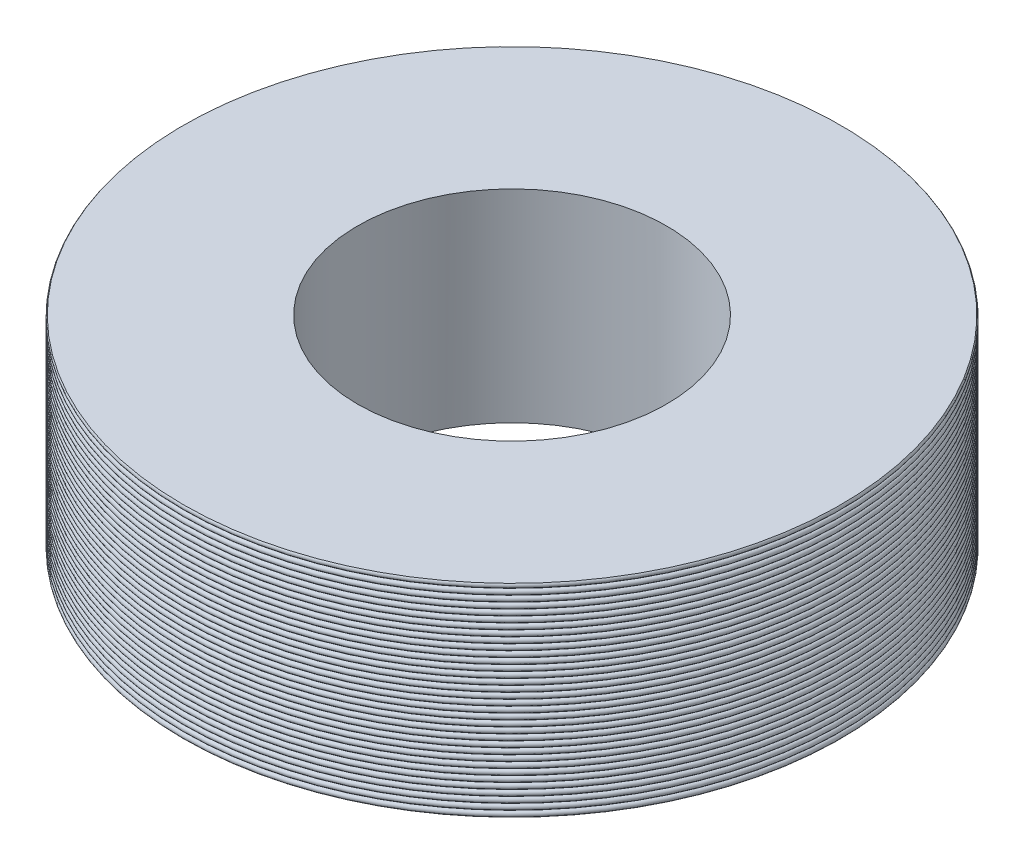
ISO-10303-21;
HEADER;
FILE_DESCRIPTION(('STEP AP214'),'2;1');
FILE_NAME('part.step','',(''),(''),'','','');
FILE_SCHEMA(('AUTOMOTIVE_DESIGN { 1 0 10303 214 1 1 1 1 }'));
ENDSEC;
DATA;
#1=APPLICATION_CONTEXT('core data for automotive mechanical design processes');
#2=APPLICATION_PROTOCOL_DEFINITION('international standard','automotive_design',2000,#1);
#3=PRODUCT_CONTEXT('',#1,'mechanical');
#4=PRODUCT('Part','Part','',(#3));
#5=PRODUCT_RELATED_PRODUCT_CATEGORY('part','',(#4));
#6=PRODUCT_DEFINITION_FORMATION('','',#4);
#7=PRODUCT_DEFINITION_CONTEXT('part definition',#1,'design');
#8=PRODUCT_DEFINITION('design','',#6,#7);
#9=PRODUCT_DEFINITION_SHAPE('','',#8);
#10=(LENGTH_UNIT() NAMED_UNIT(*) SI_UNIT(.MILLI.,.METRE.));
#11=(NAMED_UNIT(*) PLANE_ANGLE_UNIT() SI_UNIT($,.RADIAN.));
#12=(NAMED_UNIT(*) SI_UNIT($,.STERADIAN.) SOLID_ANGLE_UNIT());
#13=UNCERTAINTY_MEASURE_WITH_UNIT(LENGTH_MEASURE(1.E-05),#10,'distance_accuracy_value','');
#14=(GEOMETRIC_REPRESENTATION_CONTEXT(3) GLOBAL_UNCERTAINTY_ASSIGNED_CONTEXT((#13)) GLOBAL_UNIT_ASSIGNED_CONTEXT((#10,
#11,#12)) REPRESENTATION_CONTEXT('',''));
#15=CARTESIAN_POINT('',(0.,0.,0.));
#16=DIRECTION('',(0.,0.,1.));
#17=DIRECTION('',(1.,0.,0.));
#18=AXIS2_PLACEMENT_3D('',#15,#16,#17);
#19=CARTESIAN_POINT('',(-1.80163980901512E-11,31.625,3.05311331771918E-13));
#20=DIRECTION('',(0.,1.,0.));
#21=DIRECTION('',(0.,0.,1.));
#22=AXIS2_PLACEMENT_3D('',#19,#20,#21);
#23=TOROIDAL_SURFACE('',#22,95.1249985307958,0.874999999999956);
#24=CARTESIAN_POINT('',(-1.80024883889018E-11,30.75,3.29791749464903E-13));
#25=DIRECTION('',(0.,-1.,0.));
#26=DIRECTION('',(0.,0.,1.));
#27=AXIS2_PLACEMENT_3D('',#24,#25,#26);
#28=CIRCLE('',#27,95.1249985307958);
#29=CARTESIAN_POINT('',(-1.80193637788761E-11,30.75,95.1249985307961));
#30=VERTEX_POINT('',#29);
#31=EDGE_CURVE('E35',#30,#30,#28,.T.);
#32=ORIENTED_EDGE('',*,*,#31,.F.);
#33=EDGE_LOOP('',(#32));
#34=FACE_BOUND('',#33,.T.);
#35=CARTESIAN_POINT('',(-1.81273884791721E-11,32.4999999999994,3.29791749464903E-13));
#36=DIRECTION('',(0.,1.,0.));
#37=DIRECTION('',(0.,0.,1.));
#38=AXIS2_PLACEMENT_3D('',#35,#36,#37);
#39=CIRCLE('',#38,95.124999308604);
#40=CARTESIAN_POINT('',(-1.80193637788761E-11,32.4999999999994,95.1249993086043));
#41=VERTEX_POINT('',#40);
#42=EDGE_CURVE('E38',#41,#41,#39,.T.);
#43=ORIENTED_EDGE('',*,*,#42,.F.);
#44=EDGE_LOOP('',(#43));
#45=FACE_BOUND('',#44,.T.);
#46=ADVANCED_FACE('F15',(#34,#45),#23,.T.);
#47=CARTESIAN_POINT('',(-1.79053119608058E-11,29.875,3.19189119579733E-13));
#48=DIRECTION('',(0.,1.,0.));
#49=DIRECTION('',(0.,0.,1.));
#50=AXIS2_PLACEMENT_3D('',#47,#48,#49);
#51=TOROIDAL_SURFACE('',#50,95.1249992221977,0.874999611087508);
#52=CARTESIAN_POINT('',(-1.79192216620549E-11,28.9999999999993,2.18769447002387E-13));
#53=DIRECTION('',(0.,-1.,0.));
#54=DIRECTION('',(0.,0.,1.));
#55=AXIS2_PLACEMENT_3D('',#52,#53,#54);
#56=CIRCLE('',#55,95.1249992221984);
#57=CARTESIAN_POINT('',(-1.80193637788761E-11,28.9999999999993,95.1249992221987));
#58=VERTEX_POINT('',#57);
#59=EDGE_CURVE('E41',#58,#58,#56,.T.);
#60=ORIENTED_EDGE('',*,*,#59,.F.);
#61=EDGE_LOOP('',(#60));
#62=FACE_BOUND('',#61,.T.);
#63=ORIENTED_EDGE('',*,*,#31,.T.);
#64=EDGE_LOOP('',(#63));
#65=FACE_BOUND('',#64,.T.);
#66=ADVANCED_FACE('F458',(#62,#65),#51,.T.);
#67=CARTESIAN_POINT('',(-1.81273884791721E-11,33.375,3.33066907387547E-13));
#68=DIRECTION('',(0.,1.,0.));
#69=DIRECTION('',(0.,0.,1.));
#70=AXIS2_PLACEMENT_3D('',#67,#68,#69);
#71=TOROIDAL_SURFACE('',#70,95.1249993086034,0.874999654308353);
#72=ORIENTED_EDGE('',*,*,#42,.T.);
#73=EDGE_LOOP('',(#72));
#74=FACE_BOUND('',#73,.T.);
#75=CARTESIAN_POINT('',(-1.80302439645174E-11,34.25,3.99180688503975E-13));
#76=DIRECTION('',(0.,1.,0.));
#77=DIRECTION('',(0.,0.,1.));
#78=AXIS2_PLACEMENT_3D('',#75,#76,#77);
#79=CIRCLE('',#78,95.1249987036433);
#80=CARTESIAN_POINT('',(-1.80193637788761E-11,34.25,95.1249987036437));
#81=VERTEX_POINT('',#80);
#82=EDGE_CURVE('E44',#81,#81,#79,.T.);
#83=ORIENTED_EDGE('',*,*,#82,.F.);
#84=EDGE_LOOP('',(#83));
#85=FACE_BOUND('',#84,.T.);
#86=ADVANCED_FACE('F449',(#74,#85),#71,.T.);
#87=CARTESIAN_POINT('',(-1.80302758779591E-11,28.125,3.19189119579733E-13));
#88=DIRECTION('',(0.,1.,0.));
#89=DIRECTION('',(0.,0.,1.));
#90=AXIS2_PLACEMENT_3D('',#87,#88,#89);
#91=TOROIDAL_SURFACE('',#90,95.1249983579482,0.875000000000007);
#92=CARTESIAN_POINT('',(-1.80302439645174E-11,27.25,3.15913961657088E-13));
#93=DIRECTION('',(0.,-1.,0.));
#94=DIRECTION('',(0.,0.,1.));
#95=AXIS2_PLACEMENT_3D('',#92,#93,#94);
#96=CIRCLE('',#95,95.1249983579482);
#97=CARTESIAN_POINT('',(-1.80193637788761E-11,27.25,95.1249983579485));
#98=VERTEX_POINT('',#97);
#99=EDGE_CURVE('E47',#98,#98,#96,.T.);
#100=ORIENTED_EDGE('',*,*,#99,.F.);
#101=EDGE_LOOP('',(#100));
#102=FACE_BOUND('',#101,.T.);
#103=ORIENTED_EDGE('',*,*,#59,.T.);
#104=EDGE_LOOP('',(#103));
#105=FACE_BOUND('',#104,.T.);
#106=ADVANCED_FACE('F440',(#102,#105),#91,.T.);
#107=CARTESIAN_POINT('',(-1.80302439645174E-11,35.125,4.02455846426619E-13));
#108=DIRECTION('',(0.,1.,0.));
#109=DIRECTION('',(0.,0.,1.));
#110=AXIS2_PLACEMENT_3D('',#107,#108,#109);
#111=TOROIDAL_SURFACE('',#110,95.1249987036432,0.875000000000003);
#112=ORIENTED_EDGE('',*,*,#82,.T.);
#113=EDGE_LOOP('',(#112));
#114=FACE_BOUND('',#113,.T.);
#115=CARTESIAN_POINT('',(-1.80163661767096E-11,35.9999999999995,3.02036173849274E-13));
#116=DIRECTION('',(0.,1.,0.));
#117=DIRECTION('',(0.,0.,1.));
#118=AXIS2_PLACEMENT_3D('',#115,#116,#117);
#119=CIRCLE('',#118,95.1249993950544);
#120=CARTESIAN_POINT('',(-1.80193637788761E-11,35.9999999999995,95.1249993950547));
#121=VERTEX_POINT('',#120);
#122=EDGE_CURVE('E50',#121,#121,#119,.T.);
#123=ORIENTED_EDGE('',*,*,#122,.F.);
#124=EDGE_LOOP('',(#123));
#125=FACE_BOUND('',#124,.T.);
#126=ADVANCED_FACE('F431',(#114,#125),#111,.T.);
#127=CARTESIAN_POINT('',(-1.80302439645174E-11,26.3749999999999,3.05311331771918E-13));
#128=DIRECTION('',(0.,1.,0.));
#129=DIRECTION('',(0.,0.,1.));
#130=AXIS2_PLACEMENT_3D('',#127,#128,#129);
#131=TOROIDAL_SURFACE('',#130,95.1249991134206,0.874999556701025);
#132=CARTESIAN_POINT('',(-1.80163661767096E-11,25.499999999999,3.15913961657088E-13));
#133=DIRECTION('',(0.,-1.,0.));
#134=DIRECTION('',(0.,0.,1.));
#135=AXIS2_PLACEMENT_3D('',#132,#133,#134);
#136=CIRCLE('',#135,95.1249991134216);
#137=CARTESIAN_POINT('',(-1.80193637788761E-11,25.499999999999,95.1249991134219));
#138=VERTEX_POINT('',#137);
#139=EDGE_CURVE('E53',#138,#138,#136,.T.);
#140=ORIENTED_EDGE('',*,*,#139,.F.);
#141=EDGE_LOOP('',(#140));
#142=FACE_BOUND('',#141,.T.);
#143=ORIENTED_EDGE('',*,*,#99,.T.);
#144=EDGE_LOOP('',(#143));
#145=FACE_BOUND('',#144,.T.);
#146=ADVANCED_FACE('F422',(#142,#145),#131,.T.);
#147=CARTESIAN_POINT('',(-1.80163661767096E-11,36.875,3.05311331771918E-13));
#148=DIRECTION('',(0.,1.,0.));
#149=DIRECTION('',(0.,0.,1.));
#150=AXIS2_PLACEMENT_3D('',#147,#148,#149);
#151=TOROIDAL_SURFACE('',#150,95.1249993950539,0.87499969750684);
#152=ORIENTED_EDGE('',*,*,#122,.T.);
#153=EDGE_LOOP('',(#152));
#154=FACE_BOUND('',#153,.T.);
#155=CARTESIAN_POINT('',(-1.81135106913643E-11,37.75,3.15913961657088E-13));
#156=DIRECTION('',(0.,1.,0.));
#157=DIRECTION('',(0.,0.,1.));
#158=AXIS2_PLACEMENT_3D('',#155,#156,#157);
#159=CIRCLE('',#158,95.1249988764909);
#160=CARTESIAN_POINT('',(-1.80193637788761E-11,37.75,95.1249988764913));
#161=VERTEX_POINT('',#160);
#162=EDGE_CURVE('E56',#161,#161,#159,.T.);
#163=ORIENTED_EDGE('',*,*,#162,.F.);
#164=EDGE_LOOP('',(#163));
#165=FACE_BOUND('',#164,.T.);
#166=ADVANCED_FACE('F413',(#154,#165),#151,.T.);
#167=CARTESIAN_POINT('',(-1.80163661767096E-11,24.625,4.02455846426619E-13));
#168=DIRECTION('',(0.,1.,0.));
#169=DIRECTION('',(0.,0.,1.));
#170=AXIS2_PLACEMENT_3D('',#167,#168,#169);
#171=TOROIDAL_SURFACE('',#170,95.1249981403979,0.875000000000002);
#172=CARTESIAN_POINT('',(-1.80024883889018E-11,23.75,3.15913961657088E-13));
#173=DIRECTION('',(0.,-1.,0.));
#174=DIRECTION('',(0.,0.,1.));
#175=AXIS2_PLACEMENT_3D('',#172,#173,#174);
#176=CIRCLE('',#175,95.1249981403979);
#177=CARTESIAN_POINT('',(-1.80193637788761E-11,23.75,95.1249981403983));
#178=VERTEX_POINT('',#177);
#179=EDGE_CURVE('E59',#178,#178,#176,.T.);
#180=ORIENTED_EDGE('',*,*,#179,.F.);
#181=EDGE_LOOP('',(#180));
#182=FACE_BOUND('',#181,.T.);
#183=ORIENTED_EDGE('',*,*,#139,.T.);
#184=EDGE_LOOP('',(#183));
#185=FACE_BOUND('',#184,.T.);
#186=ADVANCED_FACE('F404',(#182,#185),#171,.T.);
#187=CARTESIAN_POINT('',(-1.81135106913643E-11,38.625,3.19189119579733E-13));
#188=DIRECTION('',(0.,1.,0.));
#189=DIRECTION('',(0.,0.,1.));
#190=AXIS2_PLACEMENT_3D('',#187,#188,#189);
#191=TOROIDAL_SURFACE('',#190,95.1249988764909,0.875000000000001);
#192=ORIENTED_EDGE('',*,*,#162,.T.);
#193=EDGE_LOOP('',(#192));
#194=FACE_BOUND('',#193,.T.);
#195=CARTESIAN_POINT('',(-1.80163661767096E-11,39.4999999999996,3.02036173849274E-13));
#196=DIRECTION('',(0.,1.,0.));
#197=DIRECTION('',(0.,0.,1.));
#198=AXIS2_PLACEMENT_3D('',#195,#196,#197);
#199=CIRCLE('',#198,95.1249994814571);
#200=CARTESIAN_POINT('',(-1.80193637788761E-11,39.4999999999996,95.1249994814574));
#201=VERTEX_POINT('',#200);
#202=EDGE_CURVE('E62',#201,#201,#199,.T.);
#203=ORIENTED_EDGE('',*,*,#202,.F.);
#204=EDGE_LOOP('',(#203));
#205=FACE_BOUND('',#204,.T.);
#206=ADVANCED_FACE('F395',(#194,#205),#191,.T.);
#207=CARTESIAN_POINT('',(-1.80024883889018E-11,22.875,3.19189119579733E-13));
#208=DIRECTION('',(0.,1.,0.));
#209=DIRECTION('',(0.,0.,1.));
#210=AXIS2_PLACEMENT_3D('',#207,#208,#209);
#211=TOROIDAL_SURFACE('',#210,95.124999026971,0.874999513502155);
#212=CARTESIAN_POINT('',(-1.79192216620549E-11,21.9999999999989,3.15913961657088E-13));
#213=DIRECTION('',(0.,-1.,0.));
#214=DIRECTION('',(0.,0.,1.));
#215=AXIS2_PLACEMENT_3D('',#212,#213,#214);
#216=CIRCLE('',#215,95.1249990269722);
#217=CARTESIAN_POINT('',(-1.80193637788761E-11,21.9999999999989,95.1249990269725));
#218=VERTEX_POINT('',#217);
#219=EDGE_CURVE('E65',#218,#218,#216,.T.);
#220=ORIENTED_EDGE('',*,*,#219,.F.);
#221=EDGE_LOOP('',(#220));
#222=FACE_BOUND('',#221,.T.);
#223=ORIENTED_EDGE('',*,*,#179,.T.);
#224=EDGE_LOOP('',(#223));
#225=FACE_BOUND('',#224,.T.);
#226=ADVANCED_FACE('F386',(#222,#225),#211,.T.);
#227=CARTESIAN_POINT('',(-1.80163661767096E-11,40.3750000000001,3.05311331771918E-13));
#228=DIRECTION('',(0.,1.,0.));
#229=DIRECTION('',(0.,0.,1.));
#230=AXIS2_PLACEMENT_3D('',#227,#228,#229);
#231=TOROIDAL_SURFACE('',#230,95.1249994814567,0.874999740729252);
#232=ORIENTED_EDGE('',*,*,#202,.T.);
#233=EDGE_LOOP('',(#232));
#234=FACE_BOUND('',#233,.T.);
#235=CARTESIAN_POINT('',(-1.80302439645174E-11,41.25,3.15913961657088E-13));
#236=DIRECTION('',(0.,1.,0.));
#237=DIRECTION('',(0.,0.,1.));
#238=AXIS2_PLACEMENT_3D('',#235,#236,#237);
#239=CIRCLE('',#238,95.1249990493385);
#240=CARTESIAN_POINT('',(-1.80193637788761E-11,41.25,95.1249990493388));
#241=VERTEX_POINT('',#240);
#242=EDGE_CURVE('E68',#241,#241,#239,.T.);
#243=ORIENTED_EDGE('',*,*,#242,.F.);
#244=EDGE_LOOP('',(#243));
#245=FACE_BOUND('',#244,.T.);
#246=ADVANCED_FACE('F377',(#234,#245),#231,.T.);
#247=CARTESIAN_POINT('',(-1.80163661767096E-11,21.1250000000001,3.33066907387547E-13));
#248=DIRECTION('',(0.,1.,0.));
#249=DIRECTION('',(0.,0.,1.));
#250=AXIS2_PLACEMENT_3D('',#247,#248,#249);
#251=TOROIDAL_SURFACE('',#250,95.1249979675504,0.875000000000001);
#252=CARTESIAN_POINT('',(-1.80163661767096E-11,20.2500000000001,3.15913961657088E-13));
#253=DIRECTION('',(0.,-1.,0.));
#254=DIRECTION('',(0.,0.,1.));
#255=AXIS2_PLACEMENT_3D('',#252,#253,#254);
#256=CIRCLE('',#255,95.1249979675504);
#257=CARTESIAN_POINT('',(-1.80193637788761E-11,20.2500000000001,95.1249979675507));
#258=VERTEX_POINT('',#257);
#259=EDGE_CURVE('E71',#258,#258,#256,.T.);
#260=ORIENTED_EDGE('',*,*,#259,.F.);
#261=EDGE_LOOP('',(#260));
#262=FACE_BOUND('',#261,.T.);
#263=ORIENTED_EDGE('',*,*,#219,.T.);
#264=EDGE_LOOP('',(#263));
#265=FACE_BOUND('',#264,.T.);
#266=ADVANCED_FACE('F368',(#262,#265),#251,.T.);
#267=CARTESIAN_POINT('',(-1.80301801376346E-11,42.125,3.19189119579733E-13));
#268=DIRECTION('',(0.,1.,0.));
#269=DIRECTION('',(-1.,0.,0.));
#270=AXIS2_PLACEMENT_3D('',#267,#268,#269);
#271=TOROIDAL_SURFACE('',#270,95.1249990493385,0.875000000000003);
#272=ORIENTED_EDGE('',*,*,#242,.T.);
#273=EDGE_LOOP('',(#272));
#274=FACE_BOUND('',#273,.T.);
#275=CARTESIAN_POINT('',(-1.79330994498627E-11,42.9999999999997,3.15913961657088E-13));
#276=DIRECTION('',(0.,1.,0.));
#277=DIRECTION('',(0.,0.,1.));
#278=AXIS2_PLACEMENT_3D('',#275,#276,#277);
#279=CIRCLE('',#278,95.1249995678305);
#280=CARTESIAN_POINT('',(-1.80193637788761E-11,42.9999999999997,95.1249995678309));
#281=VERTEX_POINT('',#280);
#282=EDGE_CURVE('E74',#281,#281,#279,.T.);
#283=ORIENTED_EDGE('',*,*,#282,.F.);
#284=EDGE_LOOP('',(#283));
#285=FACE_BOUND('',#284,.T.);
#286=ADVANCED_FACE('F359',(#274,#285),#271,.T.);
#287=CARTESIAN_POINT('',(-1.80163661767096E-11,19.3750000000001,4.16333634234434E-13));
#288=DIRECTION('',(0.,1.,0.));
#289=DIRECTION('',(0.,0.,1.));
#290=AXIS2_PLACEMENT_3D('',#287,#288,#289);
#291=TOROIDAL_SURFACE('',#290,95.1249989405547,0.874999470286612);
#292=CARTESIAN_POINT('',(-1.80302439645174E-11,18.4999999999987,2.88158386041459E-13));
#293=DIRECTION('',(0.,-1.,0.));
#294=DIRECTION('',(0.,0.,1.));
#295=AXIS2_PLACEMENT_3D('',#292,#293,#294);
#296=CIRCLE('',#295,95.1249989405562);
#297=CARTESIAN_POINT('',(-1.80193637788761E-11,18.4999999999987,95.1249989405565));
#298=VERTEX_POINT('',#297);
#299=EDGE_CURVE('E77',#298,#298,#296,.T.);
#300=ORIENTED_EDGE('',*,*,#299,.F.);
#301=EDGE_LOOP('',(#300));
#302=FACE_BOUND('',#301,.T.);
#303=ORIENTED_EDGE('',*,*,#259,.T.);
#304=EDGE_LOOP('',(#303));
#305=FACE_BOUND('',#304,.T.);
#306=ADVANCED_FACE('F350',(#302,#305),#291,.T.);
#307=CARTESIAN_POINT('',(-1.79330356229803E-11,43.875,3.19189119579733E-13));
#308=DIRECTION('',(0.,1.,0.));
#309=DIRECTION('',(0.,0.,1.));
#310=AXIS2_PLACEMENT_3D('',#307,#308,#309);
#311=TOROIDAL_SURFACE('',#310,95.1249995678303,0.874999783966107);
#312=ORIENTED_EDGE('',*,*,#282,.T.);
#313=EDGE_LOOP('',(#312));
#314=FACE_BOUND('',#313,.T.);
#315=CARTESIAN_POINT('',(-1.80302439645174E-11,44.75,3.15913961657088E-13));
#316=DIRECTION('',(0.,1.,0.));
#317=DIRECTION('',(0.,0.,1.));
#318=AXIS2_PLACEMENT_3D('',#315,#316,#317);
#319=CIRCLE('',#318,95.124999222186);
#320=CARTESIAN_POINT('',(-1.80193637788761E-11,44.75,95.1249992221863));
#321=VERTEX_POINT('',#320);
#322=EDGE_CURVE('E80',#321,#321,#319,.T.);
#323=ORIENTED_EDGE('',*,*,#322,.F.);
#324=EDGE_LOOP('',(#323));
#325=FACE_BOUND('',#324,.T.);
#326=ADVANCED_FACE('F341',(#314,#325),#311,.T.);
#327=CARTESIAN_POINT('',(-1.79330994498627E-11,17.6250000000001,3.19189119579733E-13));
#328=DIRECTION('',(0.,1.,0.));
#329=DIRECTION('',(0.,0.,1.));
#330=AXIS2_PLACEMENT_3D('',#327,#328,#329);
#331=TOROIDAL_SURFACE('',#330,95.1249977947028,0.875000000000003);
#332=CARTESIAN_POINT('',(-1.80302439645174E-11,16.7500000000001,3.15913961657088E-13));
#333=DIRECTION('',(0.,-1.,0.));
#334=DIRECTION('',(0.,0.,1.));
#335=AXIS2_PLACEMENT_3D('',#332,#333,#334);
#336=CIRCLE('',#335,95.1249977947029);
#337=CARTESIAN_POINT('',(-1.80193637788761E-11,16.7500000000001,95.1249977947032));
#338=VERTEX_POINT('',#337);
#339=EDGE_CURVE('E83',#338,#338,#336,.T.);
#340=ORIENTED_EDGE('',*,*,#339,.F.);
#341=EDGE_LOOP('',(#340));
#342=FACE_BOUND('',#341,.T.);
#343=ORIENTED_EDGE('',*,*,#299,.T.);
#344=EDGE_LOOP('',(#343));
#345=FACE_BOUND('',#344,.T.);
#346=ADVANCED_FACE('F332',(#342,#345),#331,.T.);
#347=CARTESIAN_POINT('',(-1.80302439645174E-11,45.625,3.19189119579733E-13));
#348=DIRECTION('',(0.,1.,0.));
#349=DIRECTION('',(0.,0.,1.));
#350=AXIS2_PLACEMENT_3D('',#347,#348,#349);
#351=TOROIDAL_SURFACE('',#350,95.124999222186,0.874999999999987);
#352=ORIENTED_EDGE('',*,*,#322,.T.);
#353=EDGE_LOOP('',(#352));
#354=FACE_BOUND('',#353,.T.);
#355=CARTESIAN_POINT('',(-1.80163661767096E-11,46.5,3.02036173849274E-13));
#356=DIRECTION('',(0.,1.,0.));
#357=DIRECTION('',(0.,0.,1.));
#358=AXIS2_PLACEMENT_3D('',#355,#356,#357);
#359=CIRCLE('',#358,95.1249992653979);
#360=CARTESIAN_POINT('',(-1.80193637788761E-11,46.5,95.1249992653982));
#361=VERTEX_POINT('',#360);
#362=EDGE_CURVE('E86',#361,#361,#359,.T.);
#363=ORIENTED_EDGE('',*,*,#362,.F.);
#364=EDGE_LOOP('',(#363));
#365=FACE_BOUND('',#364,.T.);
#366=ADVANCED_FACE('F323',(#354,#365),#351,.T.);
#367=CARTESIAN_POINT('',(-1.79192216620549E-11,15.8750000000001,3.19189119579733E-13));
#368=DIRECTION('',(0.,1.,0.));
#369=DIRECTION('',(0.,0.,1.));
#370=AXIS2_PLACEMENT_3D('',#367,#368,#369);
#371=TOROIDAL_SURFACE('',#370,95.1249988541289,0.874999427075917);
#372=CARTESIAN_POINT('',(-1.80163661767096E-11,14.9999999999985,3.15913961657088E-13));
#373=DIRECTION('',(0.,-1.,0.));
#374=DIRECTION('',(0.,0.,1.));
#375=AXIS2_PLACEMENT_3D('',#372,#373,#374);
#376=CIRCLE('',#375,95.1249988541305);
#377=CARTESIAN_POINT('',(-1.80193637788761E-11,14.9999999999985,95.1249988541308));
#378=VERTEX_POINT('',#377);
#379=EDGE_CURVE('E89',#378,#378,#376,.T.);
#380=ORIENTED_EDGE('',*,*,#379,.F.);
#381=EDGE_LOOP('',(#380));
#382=FACE_BOUND('',#381,.T.);
#383=ORIENTED_EDGE('',*,*,#339,.T.);
#384=EDGE_LOOP('',(#383));
#385=FACE_BOUND('',#384,.T.);
#386=ADVANCED_FACE('F314',(#382,#385),#371,.T.);
#387=CARTESIAN_POINT('',(-1.80163661767096E-11,47.375,3.05311331771918E-13));
#388=DIRECTION('',(0.,1.,0.));
#389=DIRECTION('',(0.,0.,1.));
#390=AXIS2_PLACEMENT_3D('',#387,#388,#389);
#391=TOROIDAL_SURFACE('',#390,95.1249992653979,0.875000021605947);
#392=ORIENTED_EDGE('',*,*,#362,.T.);
#393=EDGE_LOOP('',(#392));
#394=FACE_BOUND('',#393,.T.);
#395=CARTESIAN_POINT('',(-1.80024883889018E-11,48.25,3.29791749464903E-13));
#396=DIRECTION('',(0.,1.,0.));
#397=DIRECTION('',(0.,0.,1.));
#398=AXIS2_PLACEMENT_3D('',#395,#396,#397);
#399=CIRCLE('',#398,95.1249993950336);
#400=CARTESIAN_POINT('',(-1.80193637788761E-11,48.25,95.1249993950339));
#401=VERTEX_POINT('',#400);
#402=EDGE_CURVE('E92',#401,#401,#399,.T.);
#403=ORIENTED_EDGE('',*,*,#402,.F.);
#404=EDGE_LOOP('',(#403));
#405=FACE_BOUND('',#404,.T.);
#406=ADVANCED_FACE('F305',(#394,#405),#391,.T.);
#407=CARTESIAN_POINT('',(-1.80163661767096E-11,14.1250000000002,3.19189119579733E-13));
#408=DIRECTION('',(0.,1.,0.));
#409=DIRECTION('',(0.,0.,1.));
#410=AXIS2_PLACEMENT_3D('',#407,#408,#409);
#411=TOROIDAL_SURFACE('',#410,95.1249976218553,0.875000000000039);
#412=CARTESIAN_POINT('',(-1.80302439645174E-11,13.2500000000001,3.15913961657088E-13));
#413=DIRECTION('',(0.,-1.,0.));
#414=DIRECTION('',(0.,0.,1.));
#415=AXIS2_PLACEMENT_3D('',#412,#413,#414);
#416=CIRCLE('',#415,95.1249976218553);
#417=CARTESIAN_POINT('',(-1.80193637788761E-11,13.2500000000001,95.1249976218556));
#418=VERTEX_POINT('',#417);
#419=EDGE_CURVE('E95',#418,#418,#416,.T.);
#420=ORIENTED_EDGE('',*,*,#419,.F.);
#421=EDGE_LOOP('',(#420));
#422=FACE_BOUND('',#421,.T.);
#423=ORIENTED_EDGE('',*,*,#379,.T.);
#424=EDGE_LOOP('',(#423));
#425=FACE_BOUND('',#424,.T.);
#426=ADVANCED_FACE('F296',(#422,#425),#411,.T.);
#427=CARTESIAN_POINT('',(-1.80024883889018E-11,49.125,3.33066907387547E-13));
#428=DIRECTION('',(0.,1.,0.));
#429=DIRECTION('',(0.,0.,1.));
#430=AXIS2_PLACEMENT_3D('',#427,#428,#429);
#431=TOROIDAL_SURFACE('',#430,95.1249993950336,0.875000000000003);
#432=ORIENTED_EDGE('',*,*,#402,.T.);
#433=EDGE_LOOP('',(#432));
#434=FACE_BOUND('',#433,.T.);
#435=CARTESIAN_POINT('',(-1.80163661767096E-11,50.,3.15913961657088E-13));
#436=DIRECTION('',(0.,1.,0.));
#437=DIRECTION('',(0.,0.,1.));
#438=AXIS2_PLACEMENT_3D('',#435,#436,#437);
#439=CIRCLE('',#438,95.1249994382455);
#440=CARTESIAN_POINT('',(-1.80193637788761E-11,50.,95.1249994382458));
#441=VERTEX_POINT('',#440);
#442=EDGE_CURVE('E98',#441,#441,#439,.T.);
#443=ORIENTED_EDGE('',*,*,#442,.F.);
#444=EDGE_LOOP('',(#443));
#445=FACE_BOUND('',#444,.T.);
#446=ADVANCED_FACE('F287',(#434,#445),#431,.T.);
#447=CARTESIAN_POINT('',(-1.80163821334304E-11,12.3750000000001,3.19189119579733E-13));
#448=DIRECTION('',(0.,1.,0.));
#449=DIRECTION('',(-1.,0.,0.));
#450=AXIS2_PLACEMENT_3D('',#447,#448,#449);
#451=TOROIDAL_SURFACE('',#450,95.1249987677119,0.874999383860762);
#452=CARTESIAN_POINT('',(-1.81273884791721E-11,11.4999999999982,3.15913961657088E-13));
#453=DIRECTION('',(0.,-1.,0.));
#454=DIRECTION('',(0.,0.,1.));
#455=AXIS2_PLACEMENT_3D('',#452,#453,#454);
#456=CIRCLE('',#455,95.1249987677138);
#457=CARTESIAN_POINT('',(-1.80193637788761E-11,11.4999999999982,95.1249987677141));
#458=VERTEX_POINT('',#457);
#459=EDGE_CURVE('E101',#458,#458,#456,.T.);
#460=ORIENTED_EDGE('',*,*,#459,.F.);
#461=EDGE_LOOP('',(#460));
#462=FACE_BOUND('',#461,.T.);
#463=ORIENTED_EDGE('',*,*,#419,.T.);
#464=EDGE_LOOP('',(#463));
#465=FACE_BOUND('',#464,.T.);
#466=ADVANCED_FACE('F278',(#462,#465),#451,.T.);
#467=CARTESIAN_POINT('',(-1.80163023498271E-11,50.8750000000001,3.19189119579733E-13));
#468=DIRECTION('',(0.,1.,0.));
#469=DIRECTION('',(0.,0.,1.));
#470=AXIS2_PLACEMENT_3D('',#467,#468,#469);
#471=TOROIDAL_SURFACE('',#470,95.1249994382455,0.87500002160601);
#472=ORIENTED_EDGE('',*,*,#442,.T.);
#473=EDGE_LOOP('',(#472));
#474=FACE_BOUND('',#473,.T.);
#475=CARTESIAN_POINT('',(-1.80024883889018E-11,51.7499999999999,3.15913961657088E-13));
#476=DIRECTION('',(0.,1.,0.));
#477=DIRECTION('',(0.,0.,1.));
#478=AXIS2_PLACEMENT_3D('',#475,#476,#477);
#479=CIRCLE('',#478,95.1249995678811);
#480=CARTESIAN_POINT('',(-1.80193637788761E-11,51.7499999999999,95.1249995678814));
#481=VERTEX_POINT('',#480);
#482=EDGE_CURVE('E104',#481,#481,#479,.T.);
#483=ORIENTED_EDGE('',*,*,#482,.F.);
#484=EDGE_LOOP('',(#483));
#485=FACE_BOUND('',#484,.T.);
#486=ADVANCED_FACE('F269',(#474,#485),#471,.T.);
#487=CARTESIAN_POINT('',(-1.80163821334306E-11,10.6250000000001,3.05311331771918E-13));
#488=DIRECTION('',(0.,1.,0.));
#489=DIRECTION('',(0.,0.,1.));
#490=AXIS2_PLACEMENT_3D('',#487,#488,#489);
#491=TOROIDAL_SURFACE('',#490,95.1249974490077,0.875000000000017);
#492=CARTESIAN_POINT('',(-1.80163661767096E-11,9.75000000000009,2.18769447002387E-13));
#493=DIRECTION('',(0.,-1.,0.));
#494=DIRECTION('',(0.,0.,1.));
#495=AXIS2_PLACEMENT_3D('',#492,#493,#494);
#496=CIRCLE('',#495,95.1249974490078);
#497=CARTESIAN_POINT('',(-1.80193637788761E-11,9.75000000000009,95.124997449008));
#498=VERTEX_POINT('',#497);
#499=EDGE_CURVE('E107',#498,#498,#496,.T.);
#500=ORIENTED_EDGE('',*,*,#499,.F.);
#501=EDGE_LOOP('',(#500));
#502=FACE_BOUND('',#501,.T.);
#503=ORIENTED_EDGE('',*,*,#459,.T.);
#504=EDGE_LOOP('',(#503));
#505=FACE_BOUND('',#504,.T.);
#506=ADVANCED_FACE('F260',(#502,#505),#491,.T.);
#507=CARTESIAN_POINT('',(-1.80024883889018E-11,52.6249999999999,3.19189119579733E-13));
#508=DIRECTION('',(0.,1.,0.));
#509=DIRECTION('',(0.,0.,1.));
#510=AXIS2_PLACEMENT_3D('',#507,#508,#509);
#511=TOROIDAL_SURFACE('',#510,95.124999567881,0.875000000000053);
#512=ORIENTED_EDGE('',*,*,#482,.T.);
#513=EDGE_LOOP('',(#512));
#514=FACE_BOUND('',#513,.T.);
#515=CARTESIAN_POINT('',(-1.80302439645174E-11,53.4999999999999,3.15913961657088E-13));
#516=DIRECTION('',(0.,1.,0.));
#517=DIRECTION('',(0.,0.,1.));
#518=AXIS2_PLACEMENT_3D('',#515,#516,#517);
#519=CIRCLE('',#518,95.124999611093);
#520=CARTESIAN_POINT('',(-1.80193637788761E-11,53.4999999999999,95.1249996110933));
#521=VERTEX_POINT('',#520);
#522=EDGE_CURVE('E110',#521,#521,#519,.T.);
#523=ORIENTED_EDGE('',*,*,#522,.F.);
#524=EDGE_LOOP('',(#523));
#525=FACE_BOUND('',#524,.T.);
#526=ADVANCED_FACE('F251',(#514,#525),#511,.T.);
#527=CARTESIAN_POINT('',(-1.80302439645174E-11,8.8750000000001,3.05311331771918E-13));
#528=DIRECTION('',(0.,1.,0.));
#529=DIRECTION('',(0.,0.,1.));
#530=AXIS2_PLACEMENT_3D('',#527,#528,#529);
#531=TOROIDAL_SURFACE('',#530,95.1249986812865,0.874999340649848);
#532=CARTESIAN_POINT('',(-1.80163661767096E-11,7.99999999999798,3.15913961657088E-13));
#533=DIRECTION('',(0.,-1.,0.));
#534=DIRECTION('',(0.,0.,1.));
#535=AXIS2_PLACEMENT_3D('',#532,#533,#534);
#536=CIRCLE('',#535,95.1249986812886);
#537=CARTESIAN_POINT('',(-1.80193637788761E-11,7.99999999999798,95.1249986812889));
#538=VERTEX_POINT('',#537);
#539=EDGE_CURVE('E113',#538,#538,#536,.T.);
#540=ORIENTED_EDGE('',*,*,#539,.F.);
#541=EDGE_LOOP('',(#540));
#542=FACE_BOUND('',#541,.T.);
#543=ORIENTED_EDGE('',*,*,#499,.T.);
#544=EDGE_LOOP('',(#543));
#545=FACE_BOUND('',#544,.T.);
#546=ADVANCED_FACE('F242',(#542,#545),#531,.T.);
#547=CARTESIAN_POINT('',(-1.80302439645174E-11,54.3749999999999,3.19189119579733E-13));
#548=DIRECTION('',(0.,1.,0.));
#549=DIRECTION('',(0.,0.,1.));
#550=AXIS2_PLACEMENT_3D('',#547,#548,#549);
#551=TOROIDAL_SURFACE('',#550,95.124999611093,0.875000021605948);
#552=ORIENTED_EDGE('',*,*,#522,.T.);
#553=EDGE_LOOP('',(#552));
#554=FACE_BOUND('',#553,.T.);
#555=CARTESIAN_POINT('',(-1.80163661767096E-11,55.2499999999999,3.15913961657088E-13));
#556=DIRECTION('',(0.,1.,0.));
#557=DIRECTION('',(0.,0.,1.));
#558=AXIS2_PLACEMENT_3D('',#555,#556,#557);
#559=CIRCLE('',#558,95.1249997407287);
#560=CARTESIAN_POINT('',(-1.80193637788761E-11,55.2499999999999,95.124999740729));
#561=VERTEX_POINT('',#560);
#562=EDGE_CURVE('E116',#561,#561,#559,.T.);
#563=ORIENTED_EDGE('',*,*,#562,.F.);
#564=EDGE_LOOP('',(#563));
#565=FACE_BOUND('',#564,.T.);
#566=ADVANCED_FACE('F233',(#554,#565),#551,.T.);
#567=CARTESIAN_POINT('',(-1.80163661767096E-11,7.12500000000012,2.35922392732846E-13));
#568=DIRECTION('',(0.,1.,0.));
#569=DIRECTION('',(0.,0.,1.));
#570=AXIS2_PLACEMENT_3D('',#567,#568,#569);
#571=TOROIDAL_SURFACE('',#570,95.1249972761603,0.874999999999961);
#572=CARTESIAN_POINT('',(-1.80163661767096E-11,6.25000000000011,2.18769447002387E-13));
#573=DIRECTION('',(0.,-1.,0.));
#574=DIRECTION('',(0.,0.,1.));
#575=AXIS2_PLACEMENT_3D('',#572,#573,#574);
#576=CIRCLE('',#575,95.1249972761602);
#577=CARTESIAN_POINT('',(-1.80193637788761E-11,6.25000000000011,95.1249972761605));
#578=VERTEX_POINT('',#577);
#579=EDGE_CURVE('E119',#578,#578,#576,.T.);
#580=ORIENTED_EDGE('',*,*,#579,.F.);
#581=EDGE_LOOP('',(#580));
#582=FACE_BOUND('',#581,.T.);
#583=ORIENTED_EDGE('',*,*,#539,.T.);
#584=EDGE_LOOP('',(#583));
#585=FACE_BOUND('',#584,.T.);
#586=ADVANCED_FACE('F224',(#582,#585),#571,.T.);
#587=CARTESIAN_POINT('',(-1.80163661767096E-11,56.1249999999999,3.19189119579733E-13));
#588=DIRECTION('',(0.,1.,0.));
#589=DIRECTION('',(0.,0.,1.));
#590=AXIS2_PLACEMENT_3D('',#587,#588,#589);
#591=TOROIDAL_SURFACE('',#590,95.1249997407287,0.875000000000006);
#592=ORIENTED_EDGE('',*,*,#562,.T.);
#593=EDGE_LOOP('',(#592));
#594=FACE_BOUND('',#593,.T.);
#595=CARTESIAN_POINT('',(-1.80302439645174E-11,56.9999999999999,3.02036173849274E-13));
#596=DIRECTION('',(0.,1.,0.));
#597=DIRECTION('',(0.,0.,1.));
#598=AXIS2_PLACEMENT_3D('',#595,#596,#597);
#599=CIRCLE('',#598,95.1249997839406);
#600=CARTESIAN_POINT('',(-1.80193637788761E-11,56.9999999999999,95.1249997839409));
#601=VERTEX_POINT('',#600);
#602=EDGE_CURVE('E122',#601,#601,#599,.T.);
#603=ORIENTED_EDGE('',*,*,#602,.F.);
#604=EDGE_LOOP('',(#603));
#605=FACE_BOUND('',#604,.T.);
#606=ADVANCED_FACE('F215',(#594,#605),#591,.T.);
#607=CARTESIAN_POINT('',(-1.80163661767096E-11,5.3750000000001,3.33066907387547E-13));
#608=DIRECTION('',(0.,1.,0.));
#609=DIRECTION('',(0.,0.,1.));
#610=AXIS2_PLACEMENT_3D('',#607,#608,#609);
#611=TOROIDAL_SURFACE('',#610,95.1249985948688,0.874999297435012);
#612=CARTESIAN_POINT('',(-1.79192216620549E-11,4.49999999999772,3.02036173849274E-13));
#613=DIRECTION('',(0.,-1.,0.));
#614=DIRECTION('',(0.,0.,1.));
#615=AXIS2_PLACEMENT_3D('',#612,#613,#614);
#616=CIRCLE('',#615,95.1249985948711);
#617=CARTESIAN_POINT('',(-1.80193637788761E-11,4.49999999999772,95.1249985948714));
#618=VERTEX_POINT('',#617);
#619=EDGE_CURVE('E125',#618,#618,#616,.T.);
#620=ORIENTED_EDGE('',*,*,#619,.F.);
#621=EDGE_LOOP('',(#620));
#622=FACE_BOUND('',#621,.T.);
#623=ORIENTED_EDGE('',*,*,#579,.T.);
#624=EDGE_LOOP('',(#623));
#625=FACE_BOUND('',#624,.T.);
#626=ADVANCED_FACE('F206',(#622,#625),#611,.T.);
#627=CARTESIAN_POINT('',(-1.80301801376351E-11,57.8749999999999,3.05311331771918E-13));
#628=DIRECTION('',(0.,1.,0.));
#629=DIRECTION('',(0.,0.,1.));
#630=AXIS2_PLACEMENT_3D('',#627,#628,#629);
#631=TOROIDAL_SURFACE('',#630,95.1249997839406,0.875000021605949);
#632=ORIENTED_EDGE('',*,*,#602,.T.);
#633=EDGE_LOOP('',(#632));
#634=FACE_BOUND('',#633,.T.);
#635=CARTESIAN_POINT('',(-1.80163661767096E-11,58.7499999999999,3.15913961657088E-13));
#636=DIRECTION('',(0.,1.,0.));
#637=DIRECTION('',(0.,0.,1.));
#638=AXIS2_PLACEMENT_3D('',#635,#636,#637);
#639=CIRCLE('',#638,95.1249999135763);
#640=CARTESIAN_POINT('',(-1.80193637788761E-11,58.7499999999999,95.1249999135766));
#641=VERTEX_POINT('',#640);
#642=EDGE_CURVE('E34',#641,#641,#639,.T.);
#643=ORIENTED_EDGE('',*,*,#642,.F.);
#644=EDGE_LOOP('',(#643));
#645=FACE_BOUND('',#644,.T.);
#646=ADVANCED_FACE('F149',(#634,#645),#631,.T.);
#647=CARTESIAN_POINT('',(-1.7988610601094E-11,3.62500000000012,3.33066907387547E-13));
#648=DIRECTION('',(0.,1.,0.));
#649=DIRECTION('',(0.,0.,1.));
#650=AXIS2_PLACEMENT_3D('',#647,#648,#649);
#651=TOROIDAL_SURFACE('',#650,95.1249971033126,0.874999999999923);
#652=CARTESIAN_POINT('',(-1.7988610601094E-11,3.00000000000006,3.33066907387547E-13));
#653=DIRECTION('',(0.,1.,0.));
#654=DIRECTION('',(0.,0.,1.));
#655=AXIS2_PLACEMENT_3D('',#652,#653,#654);
#656=CIRCLE('',#655,95.7373695390083);
#657=CARTESIAN_POINT('',(-1.7988610601094E-11,3.00000000000006,95.7373695390086));
#658=VERTEX_POINT('',#657);
#659=EDGE_CURVE('E31',#658,#658,#656,.F.);
#660=ORIENTED_EDGE('',*,*,#659,.F.);
#661=EDGE_LOOP('',(#660));
#662=FACE_BOUND('',#661,.T.);
#663=ORIENTED_EDGE('',*,*,#619,.T.);
#664=EDGE_LOOP('',(#663));
#665=FACE_BOUND('',#664,.T.);
#666=ADVANCED_FACE('F139',(#662,#665),#651,.T.);
#667=CARTESIAN_POINT('',(-1.80163661767096E-11,59.6249999999999,3.19189119579733E-13));
#668=DIRECTION('',(0.,1.,0.));
#669=DIRECTION('',(0.,0.,1.));
#670=AXIS2_PLACEMENT_3D('',#667,#668,#669);
#671=TOROIDAL_SURFACE('',#670,95.1249999135763,0.874999999999962);
#672=ORIENTED_EDGE('',*,*,#642,.T.);
#673=EDGE_LOOP('',(#672));
#674=FACE_BOUND('',#673,.T.);
#675=CARTESIAN_POINT('',(-1.80163661767096E-11,60.4999999999999,3.02036173849274E-13));
#676=DIRECTION('',(0.,1.,0.));
#677=DIRECTION('',(0.,0.,1.));
#678=AXIS2_PLACEMENT_3D('',#675,#676,#677);
#679=CIRCLE('',#678,95.1249999567881);
#680=CARTESIAN_POINT('',(-1.80193637788761E-11,60.4999999999999,95.1249999567885));
#681=VERTEX_POINT('',#680);
#682=EDGE_CURVE('E30',#681,#681,#679,.T.);
#683=ORIENTED_EDGE('',*,*,#682,.F.);
#684=EDGE_LOOP('',(#683));
#685=FACE_BOUND('',#684,.T.);
#686=ADVANCED_FACE('F136',(#674,#685),#671,.T.);
#687=CARTESIAN_POINT('',(-97.6521169298064,3.00000000000005,-97.6521169297882));
#688=DIRECTION('',(0.,-1.,0.));
#689=DIRECTION('',(1.,0.,0.));
#690=AXIS2_PLACEMENT_3D('',#687,#688,#689);
#691=PLANE('',#690);
#692=CARTESIAN_POINT('',(1.43814545920199E-09,3.00000000000006,-4.1062038029042E-11));
#693=DIRECTION('',(0.,-1.,0.));
#694=DIRECTION('',(1.,0.,0.));
#695=AXIS2_PLACEMENT_3D('',#692,#693,#694);
#696=CIRCLE('',#695,45.);
#697=CARTESIAN_POINT('',(45.0000000014381,3.00000000000006,-4.1062038029042E-11));
#698=VERTEX_POINT('',#697);
#699=EDGE_CURVE('E26',#698,#698,#696,.T.);
#700=ORIENTED_EDGE('',*,*,#699,.F.);
#701=EDGE_LOOP('',(#700));
#702=FACE_BOUND('',#701,.T.);
#703=ORIENTED_EDGE('',*,*,#659,.T.);
#704=EDGE_LOOP('',(#703));
#705=FACE_BOUND('',#704,.T.);
#706=ADVANCED_FACE('F138',(#702,#705),#691,.T.);
#707=CARTESIAN_POINT('',(-1.80163661767096E-11,61.3749999999999,3.05311331771918E-13));
#708=DIRECTION('',(0.,1.,0.));
#709=DIRECTION('',(0.,0.,1.));
#710=AXIS2_PLACEMENT_3D('',#707,#708,#709);
#711=TOROIDAL_SURFACE('',#710,95.1249999567882,0.875000021605911);
#712=ORIENTED_EDGE('',*,*,#682,.T.);
#713=EDGE_LOOP('',(#712));
#714=FACE_BOUND('',#713,.T.);
#715=CARTESIAN_POINT('',(-1.80163661767096E-11,62.0000000000001,3.05311331771918E-13));
#716=DIRECTION('',(0.,1.,0.));
#717=DIRECTION('',(0.,0.,1.));
#718=AXIS2_PLACEMENT_3D('',#715,#716,#717);
#719=CIRCLE('',#718,95.7373724233558);
#720=CARTESIAN_POINT('',(-1.80163661767096E-11,62.0000000000001,95.7373724233561));
#721=VERTEX_POINT('',#720);
#722=EDGE_CURVE('E19',#721,#721,#719,.T.);
#723=ORIENTED_EDGE('',*,*,#722,.F.);
#724=EDGE_LOOP('',(#723));
#725=FACE_BOUND('',#724,.T.);
#726=ADVANCED_FACE('F133',(#714,#725),#711,.T.);
#727=CARTESIAN_POINT('',(1.43814682385113E-09,-2.89999999999996,-4.10634026781764E-11));
#728=DIRECTION('',(0.,1.,0.));
#729=DIRECTION('',(-1.,0.,0.));
#730=AXIS2_PLACEMENT_3D('',#727,#728,#729);
#731=CYLINDRICAL_SURFACE('',#730,45.);
#732=ORIENTED_EDGE('',*,*,#699,.T.);
#733=EDGE_LOOP('',(#732));
#734=FACE_BOUND('',#733,.T.);
#735=CARTESIAN_POINT('',(1.43813181271065E-09,62.0000000000001,-4.10483915376977E-11));
#736=DIRECTION('',(0.,1.,0.));
#737=DIRECTION('',(0.,0.,1.));
#738=AXIS2_PLACEMENT_3D('',#735,#736,#737);
#739=CIRCLE('',#738,45.);
#740=CARTESIAN_POINT('',(1.43813181271065E-09,62.0000000000001,44.9999999999589));
#741=VERTEX_POINT('',#740);
#742=EDGE_CURVE('E10',#741,#741,#739,.F.);
#743=ORIENTED_EDGE('',*,*,#742,.F.);
#744=EDGE_LOOP('',(#743));
#745=FACE_BOUND('',#744,.T.);
#746=ADVANCED_FACE('F153',(#734,#745),#731,.F.);
#747=CARTESIAN_POINT('',(-97.6521198844275,62.0000000000001,-97.6521198844092));
#748=DIRECTION('',(0.,1.,0.));
#749=DIRECTION('',(0.,0.,1.));
#750=AXIS2_PLACEMENT_3D('',#747,#748,#749);
#751=PLANE('',#750);
#752=ORIENTED_EDGE('',*,*,#742,.T.);
#753=EDGE_LOOP('',(#752));
#754=FACE_BOUND('',#753,.T.);
#755=ORIENTED_EDGE('',*,*,#722,.T.);
#756=EDGE_LOOP('',(#755));
#757=FACE_BOUND('',#756,.T.);
#758=ADVANCED_FACE('F17',(#754,#757),#751,.T.);
#759=CLOSED_SHELL('',(#46,#66,#86,#106,#126,#146,#166,#186,#206,#226,#246,#266,#286,#306,#326,
#346,#366,#386,#406,#426,#446,#466,#486,#506,#526,#546,#566,#586,#606,#626,#646,#666,#686,#706,
#726,#746,#758));
#760=MANIFOLD_SOLID_BREP('B1',#759);
#761=ADVANCED_BREP_SHAPE_REPRESENTATION('',(#18,#760),#14);
#762=SHAPE_DEFINITION_REPRESENTATION(#9,#761);
ENDSEC;
END-ISO-10303-21;
